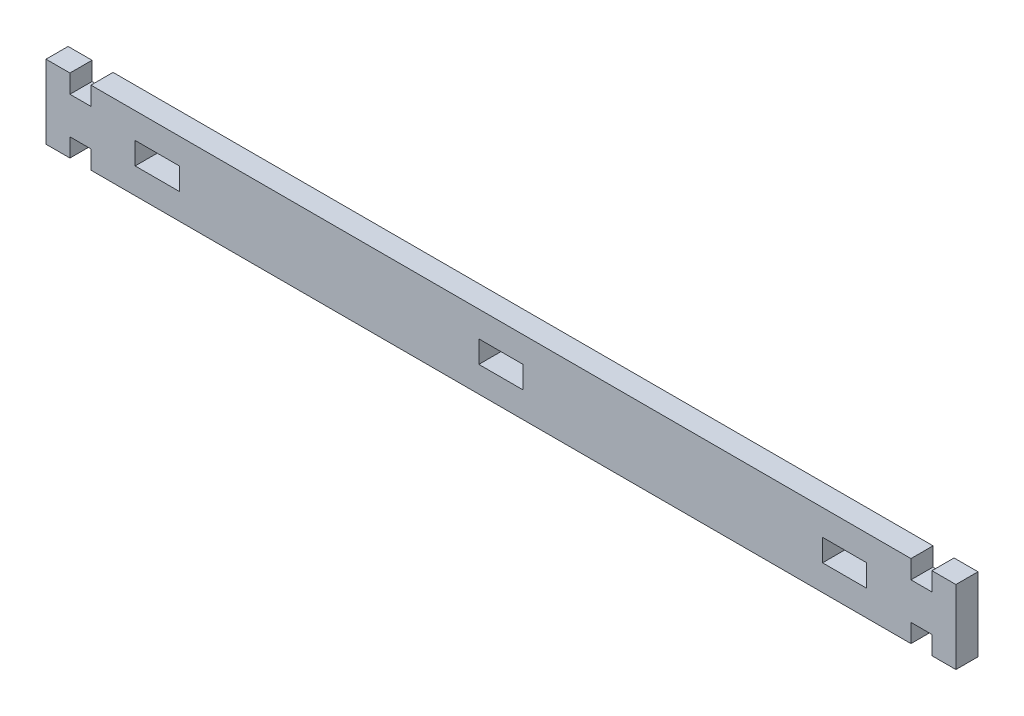
ISO-10303-21;
HEADER;
FILE_DESCRIPTION(('STEP AP214'),'2;1');
FILE_NAME('part.step','',(''),(''),'','','');
FILE_SCHEMA(('AUTOMOTIVE_DESIGN { 1 0 10303 214 1 1 1 1 }'));
ENDSEC;
DATA;
#1=APPLICATION_CONTEXT('core data for automotive mechanical design processes');
#2=APPLICATION_PROTOCOL_DEFINITION('international standard','automotive_design',2000,#1);
#3=PRODUCT_CONTEXT('',#1,'mechanical');
#4=PRODUCT('Part','Part','',(#3));
#5=PRODUCT_RELATED_PRODUCT_CATEGORY('part','',(#4));
#6=PRODUCT_DEFINITION_FORMATION('','',#4);
#7=PRODUCT_DEFINITION_CONTEXT('part definition',#1,'design');
#8=PRODUCT_DEFINITION('design','',#6,#7);
#9=PRODUCT_DEFINITION_SHAPE('','',#8);
#10=(LENGTH_UNIT() NAMED_UNIT(*) SI_UNIT(.MILLI.,.METRE.));
#11=(NAMED_UNIT(*) PLANE_ANGLE_UNIT() SI_UNIT($,.RADIAN.));
#12=(NAMED_UNIT(*) SI_UNIT($,.STERADIAN.) SOLID_ANGLE_UNIT());
#13=UNCERTAINTY_MEASURE_WITH_UNIT(LENGTH_MEASURE(1.E-05),#10,'distance_accuracy_value','');
#14=(GEOMETRIC_REPRESENTATION_CONTEXT(3) GLOBAL_UNCERTAINTY_ASSIGNED_CONTEXT((#13)) GLOBAL_UNIT_ASSIGNED_CONTEXT((#10,
#11,#12)) REPRESENTATION_CONTEXT('',''));
#15=CARTESIAN_POINT('',(0.,0.,0.));
#16=DIRECTION('',(0.,0.,1.));
#17=DIRECTION('',(1.,0.,0.));
#18=AXIS2_PLACEMENT_3D('',#15,#16,#17);
#19=CARTESIAN_POINT('',(0.,-3.,-6.));
#20=DIRECTION('',(0.,1.,0.));
#21=DIRECTION('',(-1.,0.,0.));
#22=AXIS2_PLACEMENT_3D('',#19,#20,#21);
#23=PLANE('',#22);
#24=DIRECTION('',(-1.,0.,0.));
#25=VECTOR('',#24,1.);
#26=CARTESIAN_POINT('',(0.,-3.,0.));
#27=LINE('',#26,#25);
#28=CARTESIAN_POINT('',(6.,-3.,0.));
#29=VERTEX_POINT('',#28);
#30=CARTESIAN_POINT('',(-6.,-3.,0.));
#31=VERTEX_POINT('',#30);
#32=EDGE_CURVE('E359',#29,#31,#27,.T.);
#33=ORIENTED_EDGE('',*,*,#32,.F.);
#34=DIRECTION('',(0.,0.,1.));
#35=VECTOR('',#34,1.);
#36=CARTESIAN_POINT('',(6.,-3.,-6.));
#37=LINE('',#36,#35);
#38=CARTESIAN_POINT('',(6.,-3.,-6.));
#39=VERTEX_POINT('',#38);
#40=EDGE_CURVE('E11',#39,#29,#37,.T.);
#41=ORIENTED_EDGE('',*,*,#40,.F.);
#42=DIRECTION('',(-1.,0.,0.));
#43=VECTOR('',#42,1.);
#44=CARTESIAN_POINT('',(0.,-3.,-6.));
#45=LINE('',#44,#43);
#46=CARTESIAN_POINT('',(-6.,-3.,-6.));
#47=VERTEX_POINT('',#46);
#48=EDGE_CURVE('E277',#39,#47,#45,.T.);
#49=ORIENTED_EDGE('',*,*,#48,.T.);
#50=DIRECTION('',(0.,0.,1.));
#51=VECTOR('',#50,1.);
#52=CARTESIAN_POINT('',(-6.,-3.,-6.));
#53=LINE('',#52,#51);
#54=EDGE_CURVE('E274',#47,#31,#53,.T.);
#55=ORIENTED_EDGE('',*,*,#54,.T.);
#56=EDGE_LOOP('',(#33,#41,#49,#55));
#57=FACE_BOUND('',#56,.T.);
#58=ADVANCED_FACE('F41',(#57),#23,.T.);
#59=CARTESIAN_POINT('',(6.,0.,-6.));
#60=DIRECTION('',(1.,0.,0.));
#61=DIRECTION('',(0.,0.,-1.));
#62=AXIS2_PLACEMENT_3D('',#59,#60,#61);
#63=PLANE('',#62);
#64=DIRECTION('',(0.,1.,0.));
#65=VECTOR('',#64,1.);
#66=CARTESIAN_POINT('',(6.,0.,0.));
#67=LINE('',#66,#65);
#68=CARTESIAN_POINT('',(6.,3.,0.));
#69=VERTEX_POINT('',#68);
#70=EDGE_CURVE('E365',#29,#69,#67,.T.);
#71=ORIENTED_EDGE('',*,*,#70,.T.);
#72=DIRECTION('',(0.,0.,1.));
#73=VECTOR('',#72,1.);
#74=CARTESIAN_POINT('',(6.,3.,-6.));
#75=LINE('',#74,#73);
#76=CARTESIAN_POINT('',(6.,3.,-6.));
#77=VERTEX_POINT('',#76);
#78=EDGE_CURVE('E51',#77,#69,#75,.T.);
#79=ORIENTED_EDGE('',*,*,#78,.F.);
#80=DIRECTION('',(0.,1.,0.));
#81=VECTOR('',#80,1.);
#82=CARTESIAN_POINT('',(6.,0.,-6.));
#83=LINE('',#82,#81);
#84=EDGE_CURVE('E266',#39,#77,#83,.T.);
#85=ORIENTED_EDGE('',*,*,#84,.F.);
#86=ORIENTED_EDGE('',*,*,#40,.T.);
#87=EDGE_LOOP('',(#71,#79,#85,#86));
#88=FACE_BOUND('',#87,.T.);
#89=ADVANCED_FACE('F550',(#88),#63,.F.);
#90=CARTESIAN_POINT('',(0.,3.,-6.));
#91=DIRECTION('',(0.,1.,0.));
#92=DIRECTION('',(-1.,0.,0.));
#93=AXIS2_PLACEMENT_3D('',#90,#91,#92);
#94=PLANE('',#93);
#95=DIRECTION('',(-1.,0.,0.));
#96=VECTOR('',#95,1.);
#97=CARTESIAN_POINT('',(0.,3.,0.));
#98=LINE('',#97,#96);
#99=CARTESIAN_POINT('',(-6.,3.,0.));
#100=VERTEX_POINT('',#99);
#101=EDGE_CURVE('E160',#69,#100,#98,.T.);
#102=ORIENTED_EDGE('',*,*,#101,.T.);
#103=DIRECTION('',(0.,0.,1.));
#104=VECTOR('',#103,1.);
#105=CARTESIAN_POINT('',(-6.,3.,-6.));
#106=LINE('',#105,#104);
#107=CARTESIAN_POINT('',(-6.,3.,-6.));
#108=VERTEX_POINT('',#107);
#109=EDGE_CURVE('E270',#108,#100,#106,.T.);
#110=ORIENTED_EDGE('',*,*,#109,.F.);
#111=DIRECTION('',(-1.,0.,0.));
#112=VECTOR('',#111,1.);
#113=CARTESIAN_POINT('',(0.,3.,-6.));
#114=LINE('',#113,#112);
#115=EDGE_CURVE('E260',#77,#108,#114,.T.);
#116=ORIENTED_EDGE('',*,*,#115,.F.);
#117=ORIENTED_EDGE('',*,*,#78,.T.);
#118=EDGE_LOOP('',(#102,#110,#116,#117));
#119=FACE_BOUND('',#118,.T.);
#120=ADVANCED_FACE('F271',(#119),#94,.F.);
#121=CARTESIAN_POINT('',(-87.3,0.,-6.));
#122=DIRECTION('',(1.,0.,0.));
#123=DIRECTION('',(0.,0.,-1.));
#124=AXIS2_PLACEMENT_3D('',#121,#122,#123);
#125=PLANE('',#124);
#126=DIRECTION('',(0.,1.,0.));
#127=VECTOR('',#126,1.);
#128=CARTESIAN_POINT('',(-87.3,0.,0.));
#129=LINE('',#128,#127);
#130=CARTESIAN_POINT('',(-87.3,-3.00000000000001,0.));
#131=VERTEX_POINT('',#130);
#132=CARTESIAN_POINT('',(-87.3,2.99999999999999,0.));
#133=VERTEX_POINT('',#132);
#134=EDGE_CURVE('E348',#131,#133,#129,.T.);
#135=ORIENTED_EDGE('',*,*,#134,.T.);
#136=DIRECTION('',(0.,0.,1.));
#137=VECTOR('',#136,1.);
#138=CARTESIAN_POINT('',(-87.3,2.99999999999999,-6.));
#139=LINE('',#138,#137);
#140=CARTESIAN_POINT('',(-87.3,2.99999999999999,-6.));
#141=VERTEX_POINT('',#140);
#142=EDGE_CURVE('E370',#141,#133,#139,.T.);
#143=ORIENTED_EDGE('',*,*,#142,.F.);
#144=DIRECTION('',(0.,1.,0.));
#145=VECTOR('',#144,1.);
#146=CARTESIAN_POINT('',(-87.3,0.,-6.));
#147=LINE('',#146,#145);
#148=CARTESIAN_POINT('',(-87.3,-3.00000000000001,-6.));
#149=VERTEX_POINT('',#148);
#150=EDGE_CURVE('E508',#149,#141,#147,.T.);
#151=ORIENTED_EDGE('',*,*,#150,.F.);
#152=DIRECTION('',(0.,0.,1.));
#153=VECTOR('',#152,1.);
#154=CARTESIAN_POINT('',(-87.3,-3.00000000000001,-6.));
#155=LINE('',#154,#153);
#156=EDGE_CURVE('E376',#149,#131,#155,.T.);
#157=ORIENTED_EDGE('',*,*,#156,.T.);
#158=EDGE_LOOP('',(#135,#143,#151,#157));
#159=FACE_BOUND('',#158,.T.);
#160=ADVANCED_FACE('F526',(#159),#125,.F.);
#161=CARTESIAN_POINT('',(0.,2.99999999999999,-6.));
#162=DIRECTION('',(0.,-1.,0.));
#163=DIRECTION('',(0.,0.,-1.));
#164=AXIS2_PLACEMENT_3D('',#161,#162,#163);
#165=PLANE('',#164);
#166=DIRECTION('',(1.,0.,0.));
#167=VECTOR('',#166,1.);
#168=CARTESIAN_POINT('',(0.,2.99999999999999,0.));
#169=LINE('',#168,#167);
#170=CARTESIAN_POINT('',(-99.3,2.99999999999999,0.));
#171=VERTEX_POINT('',#170);
#172=EDGE_CURVE('E356',#171,#133,#169,.T.);
#173=ORIENTED_EDGE('',*,*,#172,.F.);
#174=DIRECTION('',(0.,0.,1.));
#175=VECTOR('',#174,1.);
#176=CARTESIAN_POINT('',(-99.3,2.99999999999999,-6.));
#177=LINE('',#176,#175);
#178=CARTESIAN_POINT('',(-99.3,2.99999999999999,-6.));
#179=VERTEX_POINT('',#178);
#180=EDGE_CURVE('E372',#179,#171,#177,.T.);
#181=ORIENTED_EDGE('',*,*,#180,.F.);
#182=DIRECTION('',(1.,0.,0.));
#183=VECTOR('',#182,1.);
#184=CARTESIAN_POINT('',(0.,2.99999999999999,-6.));
#185=LINE('',#184,#183);
#186=EDGE_CURVE('E279',#179,#141,#185,.T.);
#187=ORIENTED_EDGE('',*,*,#186,.T.);
#188=ORIENTED_EDGE('',*,*,#142,.T.);
#189=EDGE_LOOP('',(#173,#181,#187,#188));
#190=FACE_BOUND('',#189,.T.);
#191=ADVANCED_FACE('F518',(#190),#165,.T.);
#192=CARTESIAN_POINT('',(-99.3,0.,-6.));
#193=DIRECTION('',(1.,0.,0.));
#194=DIRECTION('',(0.,0.,-1.));
#195=AXIS2_PLACEMENT_3D('',#192,#193,#194);
#196=PLANE('',#195);
#197=DIRECTION('',(0.,1.,0.));
#198=VECTOR('',#197,1.);
#199=CARTESIAN_POINT('',(-99.3,0.,0.));
#200=LINE('',#199,#198);
#201=CARTESIAN_POINT('',(-99.3,-3.00000000000001,0.));
#202=VERTEX_POINT('',#201);
#203=EDGE_CURVE('E353',#202,#171,#200,.T.);
#204=ORIENTED_EDGE('',*,*,#203,.F.);
#205=DIRECTION('',(0.,0.,1.));
#206=VECTOR('',#205,1.);
#207=CARTESIAN_POINT('',(-99.3,-3.00000000000001,-6.));
#208=LINE('',#207,#206);
#209=CARTESIAN_POINT('',(-99.3,-3.00000000000001,-6.));
#210=VERTEX_POINT('',#209);
#211=EDGE_CURVE('E374',#210,#202,#208,.T.);
#212=ORIENTED_EDGE('',*,*,#211,.F.);
#213=DIRECTION('',(0.,1.,0.));
#214=VECTOR('',#213,1.);
#215=CARTESIAN_POINT('',(-99.3,0.,-6.));
#216=LINE('',#215,#214);
#217=EDGE_CURVE('E512',#210,#179,#216,.T.);
#218=ORIENTED_EDGE('',*,*,#217,.T.);
#219=ORIENTED_EDGE('',*,*,#180,.T.);
#220=EDGE_LOOP('',(#204,#212,#218,#219));
#221=FACE_BOUND('',#220,.T.);
#222=ADVANCED_FACE('F532',(#221),#196,.T.);
#223=CARTESIAN_POINT('',(99.3,0.,-6.));
#224=DIRECTION('',(1.,0.,0.));
#225=DIRECTION('',(0.,0.,-1.));
#226=AXIS2_PLACEMENT_3D('',#223,#224,#225);
#227=PLANE('',#226);
#228=DIRECTION('',(0.,1.,0.));
#229=VECTOR('',#228,1.);
#230=CARTESIAN_POINT('',(99.3,0.,0.));
#231=LINE('',#230,#229);
#232=CARTESIAN_POINT('',(99.3,-3.,0.));
#233=VERTEX_POINT('',#232);
#234=CARTESIAN_POINT('',(99.3,3.,0.));
#235=VERTEX_POINT('',#234);
#236=EDGE_CURVE('E337',#233,#235,#231,.T.);
#237=ORIENTED_EDGE('',*,*,#236,.T.);
#238=DIRECTION('',(0.,0.,1.));
#239=VECTOR('',#238,1.);
#240=CARTESIAN_POINT('',(99.3,3.,-6.));
#241=LINE('',#240,#239);
#242=CARTESIAN_POINT('',(99.3,3.,-6.));
#243=VERTEX_POINT('',#242);
#244=EDGE_CURVE('E379',#243,#235,#241,.T.);
#245=ORIENTED_EDGE('',*,*,#244,.F.);
#246=DIRECTION('',(0.,1.,0.));
#247=VECTOR('',#246,1.);
#248=CARTESIAN_POINT('',(99.3,0.,-6.));
#249=LINE('',#248,#247);
#250=CARTESIAN_POINT('',(99.3,-3.,-6.));
#251=VERTEX_POINT('',#250);
#252=EDGE_CURVE('E448',#251,#243,#249,.T.);
#253=ORIENTED_EDGE('',*,*,#252,.F.);
#254=DIRECTION('',(0.,0.,1.));
#255=VECTOR('',#254,1.);
#256=CARTESIAN_POINT('',(99.3,-3.,-6.));
#257=LINE('',#256,#255);
#258=EDGE_CURVE('E385',#251,#233,#257,.T.);
#259=ORIENTED_EDGE('',*,*,#258,.T.);
#260=EDGE_LOOP('',(#237,#245,#253,#259));
#261=FACE_BOUND('',#260,.T.);
#262=ADVANCED_FACE('F561',(#261),#227,.F.);
#263=CARTESIAN_POINT('',(0.,3.,-6.));
#264=DIRECTION('',(0.,-1.,0.));
#265=DIRECTION('',(0.,0.,-1.));
#266=AXIS2_PLACEMENT_3D('',#263,#264,#265);
#267=PLANE('',#266);
#268=DIRECTION('',(1.,0.,0.));
#269=VECTOR('',#268,1.);
#270=CARTESIAN_POINT('',(0.,3.,0.));
#271=LINE('',#270,#269);
#272=CARTESIAN_POINT('',(87.3,3.,0.));
#273=VERTEX_POINT('',#272);
#274=EDGE_CURVE('E345',#273,#235,#271,.T.);
#275=ORIENTED_EDGE('',*,*,#274,.F.);
#276=DIRECTION('',(0.,0.,1.));
#277=VECTOR('',#276,1.);
#278=CARTESIAN_POINT('',(87.3,3.,-6.));
#279=LINE('',#278,#277);
#280=CARTESIAN_POINT('',(87.3,3.,-6.));
#281=VERTEX_POINT('',#280);
#282=EDGE_CURVE('E381',#281,#273,#279,.T.);
#283=ORIENTED_EDGE('',*,*,#282,.F.);
#284=DIRECTION('',(1.,0.,0.));
#285=VECTOR('',#284,1.);
#286=CARTESIAN_POINT('',(0.,3.,-6.));
#287=LINE('',#286,#285);
#288=EDGE_CURVE('E505',#281,#243,#287,.T.);
#289=ORIENTED_EDGE('',*,*,#288,.T.);
#290=ORIENTED_EDGE('',*,*,#244,.T.);
#291=EDGE_LOOP('',(#275,#283,#289,#290));
#292=FACE_BOUND('',#291,.T.);
#293=ADVANCED_FACE('F565',(#292),#267,.T.);
#294=CARTESIAN_POINT('',(87.3,2.019218126037E-13,-6.));
#295=DIRECTION('',(1.,0.,0.));
#296=DIRECTION('',(0.,1.,0.));
#297=AXIS2_PLACEMENT_3D('',#294,#295,#296);
#298=PLANE('',#297);
#299=DIRECTION('',(0.,1.,0.));
#300=VECTOR('',#299,1.);
#301=CARTESIAN_POINT('',(87.3,2.019218126037E-13,0.));
#302=LINE('',#301,#300);
#303=CARTESIAN_POINT('',(87.3,-3.,0.));
#304=VERTEX_POINT('',#303);
#305=EDGE_CURVE('E342',#304,#273,#302,.T.);
#306=ORIENTED_EDGE('',*,*,#305,.F.);
#307=DIRECTION('',(0.,0.,1.));
#308=VECTOR('',#307,1.);
#309=CARTESIAN_POINT('',(87.3,-3.,-6.));
#310=LINE('',#309,#308);
#311=CARTESIAN_POINT('',(87.3,-3.,-6.));
#312=VERTEX_POINT('',#311);
#313=EDGE_CURVE('E383',#312,#304,#310,.T.);
#314=ORIENTED_EDGE('',*,*,#313,.F.);
#315=DIRECTION('',(0.,1.,0.));
#316=VECTOR('',#315,1.);
#317=CARTESIAN_POINT('',(87.3,2.019218126037E-13,-6.));
#318=LINE('',#317,#316);
#319=EDGE_CURVE('E502',#312,#281,#318,.T.);
#320=ORIENTED_EDGE('',*,*,#319,.T.);
#321=ORIENTED_EDGE('',*,*,#282,.T.);
#322=EDGE_LOOP('',(#306,#314,#320,#321));
#323=FACE_BOUND('',#322,.T.);
#324=ADVANCED_FACE('F571',(#323),#298,.T.);
#325=CARTESIAN_POINT('',(-117.,0.,-6.));
#326=DIRECTION('',(-1.,0.,0.));
#327=DIRECTION('',(0.,0.,1.));
#328=AXIS2_PLACEMENT_3D('',#325,#326,#327);
#329=PLANE('',#328);
#330=DIRECTION('',(0.,-1.,0.));
#331=VECTOR('',#330,1.);
#332=CARTESIAN_POINT('',(-117.,0.,0.));
#333=LINE('',#332,#331);
#334=CARTESIAN_POINT('',(-117.,9.99999999999999,0.));
#335=VERTEX_POINT('',#334);
#336=CARTESIAN_POINT('',(-117.,4.99999999999999,0.));
#337=VERTEX_POINT('',#336);
#338=EDGE_CURVE('E284',#335,#337,#333,.T.);
#339=ORIENTED_EDGE('',*,*,#338,.T.);
#340=DIRECTION('',(0.,0.,1.));
#341=VECTOR('',#340,1.);
#342=CARTESIAN_POINT('',(-117.,4.99999999999999,-6.));
#343=LINE('',#342,#341);
#344=CARTESIAN_POINT('',(-117.,4.99999999999999,-6.));
#345=VERTEX_POINT('',#344);
#346=EDGE_CURVE('E388',#345,#337,#343,.T.);
#347=ORIENTED_EDGE('',*,*,#346,.F.);
#348=DIRECTION('',(0.,-1.,0.));
#349=VECTOR('',#348,1.);
#350=CARTESIAN_POINT('',(-117.,0.,-6.));
#351=LINE('',#350,#349);
#352=CARTESIAN_POINT('',(-117.,9.99999999999999,-6.));
#353=VERTEX_POINT('',#352);
#354=EDGE_CURVE('E366',#353,#345,#351,.T.);
#355=ORIENTED_EDGE('',*,*,#354,.F.);
#356=DIRECTION('',(0.,0.,1.));
#357=VECTOR('',#356,1.);
#358=CARTESIAN_POINT('',(-117.,9.99999999999999,-6.));
#359=LINE('',#358,#357);
#360=EDGE_CURVE('E45',#353,#335,#359,.T.);
#361=ORIENTED_EDGE('',*,*,#360,.T.);
#362=EDGE_LOOP('',(#339,#347,#355,#361));
#363=FACE_BOUND('',#362,.T.);
#364=ADVANCED_FACE('F434',(#363),#329,.F.);
#365=CARTESIAN_POINT('',(0.,5.00000000000001,-6.));
#366=DIRECTION('',(0.,-1.,0.));
#367=DIRECTION('',(1.,0.,0.));
#368=AXIS2_PLACEMENT_3D('',#365,#366,#367);
#369=PLANE('',#368);
#370=DIRECTION('',(1.,0.,0.));
#371=VECTOR('',#370,1.);
#372=CARTESIAN_POINT('',(0.,5.00000000000001,0.));
#373=LINE('',#372,#371);
#374=CARTESIAN_POINT('',(-111.3,4.99999999999999,0.));
#375=VERTEX_POINT('',#374);
#376=EDGE_CURVE('E334',#337,#375,#373,.T.);
#377=ORIENTED_EDGE('',*,*,#376,.T.);
#378=DIRECTION('',(0.,0.,1.));
#379=VECTOR('',#378,1.);
#380=CARTESIAN_POINT('',(-111.3,4.99999999999999,-6.));
#381=LINE('',#380,#379);
#382=CARTESIAN_POINT('',(-111.3,4.99999999999999,-6.));
#383=VERTEX_POINT('',#382);
#384=EDGE_CURVE('E391',#383,#375,#381,.T.);
#385=ORIENTED_EDGE('',*,*,#384,.F.);
#386=DIRECTION('',(1.,0.,0.));
#387=VECTOR('',#386,1.);
#388=CARTESIAN_POINT('',(0.,5.00000000000001,-6.));
#389=LINE('',#388,#387);
#390=EDGE_CURVE('E445',#345,#383,#389,.T.);
#391=ORIENTED_EDGE('',*,*,#390,.F.);
#392=ORIENTED_EDGE('',*,*,#346,.T.);
#393=EDGE_LOOP('',(#377,#385,#391,#392));
#394=FACE_BOUND('',#393,.T.);
#395=ADVANCED_FACE('F444',(#394),#369,.F.);
#396=CARTESIAN_POINT('',(-111.3,0.,-6.));
#397=DIRECTION('',(-1.,0.,0.));
#398=DIRECTION('',(0.,0.,1.));
#399=AXIS2_PLACEMENT_3D('',#396,#397,#398);
#400=PLANE('',#399);
#401=DIRECTION('',(0.,-1.,0.));
#402=VECTOR('',#401,1.);
#403=CARTESIAN_POINT('',(-111.3,0.,0.));
#404=LINE('',#403,#402);
#405=CARTESIAN_POINT('',(-111.3,9.99999999999999,0.));
#406=VERTEX_POINT('',#405);
#407=EDGE_CURVE('E331',#406,#375,#404,.T.);
#408=ORIENTED_EDGE('',*,*,#407,.F.);
#409=DIRECTION('',(0.,0.,1.));
#410=VECTOR('',#409,1.);
#411=CARTESIAN_POINT('',(-111.3,9.99999999999999,-6.));
#412=LINE('',#411,#410);
#413=CARTESIAN_POINT('',(-111.3,9.99999999999999,-6.));
#414=VERTEX_POINT('',#413);
#415=EDGE_CURVE('E393',#414,#406,#412,.T.);
#416=ORIENTED_EDGE('',*,*,#415,.F.);
#417=DIRECTION('',(0.,-1.,0.));
#418=VECTOR('',#417,1.);
#419=CARTESIAN_POINT('',(-111.3,0.,-6.));
#420=LINE('',#419,#418);
#421=EDGE_CURVE('E449',#414,#383,#420,.T.);
#422=ORIENTED_EDGE('',*,*,#421,.T.);
#423=ORIENTED_EDGE('',*,*,#384,.T.);
#424=EDGE_LOOP('',(#408,#416,#422,#423));
#425=FACE_BOUND('',#424,.T.);
#426=ADVANCED_FACE('F578',(#425),#400,.T.);
#427=CARTESIAN_POINT('',(0.,10.,-6.));
#428=DIRECTION('',(0.,-1.,0.));
#429=DIRECTION('',(1.,0.,0.));
#430=AXIS2_PLACEMENT_3D('',#427,#428,#429);
#431=PLANE('',#430);
#432=DIRECTION('',(1.,0.,0.));
#433=VECTOR('',#432,1.);
#434=CARTESIAN_POINT('',(0.,10.,0.));
#435=LINE('',#434,#433);
#436=CARTESIAN_POINT('',(111.3,10.,0.));
#437=VERTEX_POINT('',#436);
#438=EDGE_CURVE('E329',#406,#437,#435,.T.);
#439=ORIENTED_EDGE('',*,*,#438,.T.);
#440=DIRECTION('',(0.,0.,1.));
#441=VECTOR('',#440,1.);
#442=CARTESIAN_POINT('',(111.3,10.,-6.));
#443=LINE('',#442,#441);
#444=CARTESIAN_POINT('',(111.3,10.,-6.));
#445=VERTEX_POINT('',#444);
#446=EDGE_CURVE('E395',#445,#437,#443,.T.);
#447=ORIENTED_EDGE('',*,*,#446,.F.);
#448=DIRECTION('',(1.,0.,0.));
#449=VECTOR('',#448,1.);
#450=CARTESIAN_POINT('',(0.,10.,-6.));
#451=LINE('',#450,#449);
#452=EDGE_CURVE('E496',#414,#445,#451,.T.);
#453=ORIENTED_EDGE('',*,*,#452,.F.);
#454=ORIENTED_EDGE('',*,*,#415,.T.);
#455=EDGE_LOOP('',(#439,#447,#453,#454));
#456=FACE_BOUND('',#455,.T.);
#457=ADVANCED_FACE('F581',(#456),#431,.F.);
#458=CARTESIAN_POINT('',(111.3,0.,-6.));
#459=DIRECTION('',(-1.,0.,0.));
#460=DIRECTION('',(0.,0.,1.));
#461=AXIS2_PLACEMENT_3D('',#458,#459,#460);
#462=PLANE('',#461);
#463=DIRECTION('',(0.,-1.,0.));
#464=VECTOR('',#463,1.);
#465=CARTESIAN_POINT('',(111.3,0.,0.));
#466=LINE('',#465,#464);
#467=CARTESIAN_POINT('',(111.3,5.00000000000002,0.));
#468=VERTEX_POINT('',#467);
#469=EDGE_CURVE('E326',#437,#468,#466,.T.);
#470=ORIENTED_EDGE('',*,*,#469,.T.);
#471=DIRECTION('',(0.,0.,1.));
#472=VECTOR('',#471,1.);
#473=CARTESIAN_POINT('',(111.3,5.00000000000002,-6.));
#474=LINE('',#473,#472);
#475=CARTESIAN_POINT('',(111.3,5.00000000000002,-6.));
#476=VERTEX_POINT('',#475);
#477=EDGE_CURVE('E398',#476,#468,#474,.T.);
#478=ORIENTED_EDGE('',*,*,#477,.F.);
#479=DIRECTION('',(0.,-1.,0.));
#480=VECTOR('',#479,1.);
#481=CARTESIAN_POINT('',(111.3,0.,-6.));
#482=LINE('',#481,#480);
#483=EDGE_CURVE('E494',#445,#476,#482,.T.);
#484=ORIENTED_EDGE('',*,*,#483,.F.);
#485=ORIENTED_EDGE('',*,*,#446,.T.);
#486=EDGE_LOOP('',(#470,#478,#484,#485));
#487=FACE_BOUND('',#486,.T.);
#488=ADVANCED_FACE('F585',(#487),#462,.F.);
#489=CARTESIAN_POINT('',(0.,5.,-6.));
#490=DIRECTION('',(0.,1.,0.));
#491=DIRECTION('',(-1.,0.,0.));
#492=AXIS2_PLACEMENT_3D('',#489,#490,#491);
#493=PLANE('',#492);
#494=DIRECTION('',(-1.,0.,0.));
#495=VECTOR('',#494,1.);
#496=CARTESIAN_POINT('',(0.,5.,0.));
#497=LINE('',#496,#495);
#498=CARTESIAN_POINT('',(117.,5.00000000000002,0.));
#499=VERTEX_POINT('',#498);
#500=EDGE_CURVE('E323',#499,#468,#497,.T.);
#501=ORIENTED_EDGE('',*,*,#500,.F.);
#502=DIRECTION('',(0.,0.,1.));
#503=VECTOR('',#502,1.);
#504=CARTESIAN_POINT('',(117.,5.00000000000002,-6.));
#505=LINE('',#504,#503);
#506=CARTESIAN_POINT('',(117.,5.00000000000002,-6.));
#507=VERTEX_POINT('',#506);
#508=EDGE_CURVE('E400',#507,#499,#505,.T.);
#509=ORIENTED_EDGE('',*,*,#508,.F.);
#510=DIRECTION('',(-1.,0.,0.));
#511=VECTOR('',#510,1.);
#512=CARTESIAN_POINT('',(0.,5.,-6.));
#513=LINE('',#512,#511);
#514=EDGE_CURVE('E491',#507,#476,#513,.T.);
#515=ORIENTED_EDGE('',*,*,#514,.T.);
#516=ORIENTED_EDGE('',*,*,#477,.T.);
#517=EDGE_LOOP('',(#501,#509,#515,#516));
#518=FACE_BOUND('',#517,.T.);
#519=ADVANCED_FACE('F589',(#518),#493,.T.);
#520=CARTESIAN_POINT('',(117.,0.,-6.));
#521=DIRECTION('',(-1.,0.,0.));
#522=DIRECTION('',(0.,0.,1.));
#523=AXIS2_PLACEMENT_3D('',#520,#521,#522);
#524=PLANE('',#523);
#525=DIRECTION('',(0.,-1.,0.));
#526=VECTOR('',#525,1.);
#527=CARTESIAN_POINT('',(117.,0.,0.));
#528=LINE('',#527,#526);
#529=CARTESIAN_POINT('',(117.,10.,0.));
#530=VERTEX_POINT('',#529);
#531=EDGE_CURVE('E314',#530,#499,#528,.T.);
#532=ORIENTED_EDGE('',*,*,#531,.F.);
#533=DIRECTION('',(0.,0.,1.));
#534=VECTOR('',#533,1.);
#535=CARTESIAN_POINT('',(117.,10.,-6.));
#536=LINE('',#535,#534);
#537=CARTESIAN_POINT('',(117.,10.,-6.));
#538=VERTEX_POINT('',#537);
#539=EDGE_CURVE('E402',#538,#530,#536,.T.);
#540=ORIENTED_EDGE('',*,*,#539,.F.);
#541=DIRECTION('',(0.,-1.,0.));
#542=VECTOR('',#541,1.);
#543=CARTESIAN_POINT('',(117.,0.,-6.));
#544=LINE('',#543,#542);
#545=EDGE_CURVE('E483',#538,#507,#544,.T.);
#546=ORIENTED_EDGE('',*,*,#545,.T.);
#547=ORIENTED_EDGE('',*,*,#508,.T.);
#548=EDGE_LOOP('',(#532,#540,#546,#547));
#549=FACE_BOUND('',#548,.T.);
#550=ADVANCED_FACE('F593',(#549),#524,.T.);
#551=CARTESIAN_POINT('',(0.,10.,-6.));
#552=DIRECTION('',(0.,-1.,0.));
#553=DIRECTION('',(1.,0.,0.));
#554=AXIS2_PLACEMENT_3D('',#551,#552,#553);
#555=PLANE('',#554);
#556=DIRECTION('',(1.,0.,0.));
#557=VECTOR('',#556,1.);
#558=CARTESIAN_POINT('',(0.,10.,0.));
#559=LINE('',#558,#557);
#560=CARTESIAN_POINT('',(123.5,10.,0.));
#561=VERTEX_POINT('',#560);
#562=EDGE_CURVE('E320',#530,#561,#559,.T.);
#563=ORIENTED_EDGE('',*,*,#562,.T.);
#564=DIRECTION('',(0.,0.,1.));
#565=VECTOR('',#564,1.);
#566=CARTESIAN_POINT('',(123.5,10.,-6.));
#567=LINE('',#566,#565);
#568=CARTESIAN_POINT('',(123.5,10.,-6.));
#569=VERTEX_POINT('',#568);
#570=EDGE_CURVE('E404',#569,#561,#567,.T.);
#571=ORIENTED_EDGE('',*,*,#570,.F.);
#572=DIRECTION('',(1.,0.,0.));
#573=VECTOR('',#572,1.);
#574=CARTESIAN_POINT('',(0.,10.,-6.));
#575=LINE('',#574,#573);
#576=EDGE_CURVE('E489',#538,#569,#575,.T.);
#577=ORIENTED_EDGE('',*,*,#576,.F.);
#578=ORIENTED_EDGE('',*,*,#539,.T.);
#579=EDGE_LOOP('',(#563,#571,#577,#578));
#580=FACE_BOUND('',#579,.T.);
#581=ADVANCED_FACE('F597',(#580),#555,.F.);
#582=CARTESIAN_POINT('',(123.5,0.,-6.));
#583=DIRECTION('',(1.,0.,0.));
#584=DIRECTION('',(0.,0.,-1.));
#585=AXIS2_PLACEMENT_3D('',#582,#583,#584);
#586=PLANE('',#585);
#587=DIRECTION('',(0.,1.,0.));
#588=VECTOR('',#587,1.);
#589=CARTESIAN_POINT('',(123.5,0.,0.));
#590=LINE('',#589,#588);
#591=CARTESIAN_POINT('',(123.5,-9.99999999999998,0.));
#592=VERTEX_POINT('',#591);
#593=EDGE_CURVE('E317',#592,#561,#590,.T.);
#594=ORIENTED_EDGE('',*,*,#593,.F.);
#595=DIRECTION('',(0.,0.,1.));
#596=VECTOR('',#595,1.);
#597=CARTESIAN_POINT('',(123.5,-9.99999999999998,-6.));
#598=LINE('',#597,#596);
#599=CARTESIAN_POINT('',(123.5,-9.99999999999998,-6.));
#600=VERTEX_POINT('',#599);
#601=EDGE_CURVE('E406',#600,#592,#598,.T.);
#602=ORIENTED_EDGE('',*,*,#601,.F.);
#603=DIRECTION('',(0.,1.,0.));
#604=VECTOR('',#603,1.);
#605=CARTESIAN_POINT('',(123.5,0.,-6.));
#606=LINE('',#605,#604);
#607=EDGE_CURVE('E486',#600,#569,#606,.T.);
#608=ORIENTED_EDGE('',*,*,#607,.T.);
#609=ORIENTED_EDGE('',*,*,#570,.T.);
#610=EDGE_LOOP('',(#594,#602,#608,#609));
#611=FACE_BOUND('',#610,.T.);
#612=ADVANCED_FACE('F602',(#611),#586,.T.);
#613=CARTESIAN_POINT('',(0.,-9.99999999999999,-6.));
#614=DIRECTION('',(0.,-1.,0.));
#615=DIRECTION('',(1.,0.,0.));
#616=AXIS2_PLACEMENT_3D('',#613,#614,#615);
#617=PLANE('',#616);
#618=DIRECTION('',(1.,0.,0.));
#619=VECTOR('',#618,1.);
#620=CARTESIAN_POINT('',(0.,-9.99999999999999,0.));
#621=LINE('',#620,#619);
#622=CARTESIAN_POINT('',(117.,-9.99999999999998,0.));
#623=VERTEX_POINT('',#622);
#624=EDGE_CURVE('E313',#623,#592,#621,.T.);
#625=ORIENTED_EDGE('',*,*,#624,.F.);
#626=DIRECTION('',(0.,0.,1.));
#627=VECTOR('',#626,1.);
#628=CARTESIAN_POINT('',(117.,-9.99999999999998,-6.));
#629=LINE('',#628,#627);
#630=CARTESIAN_POINT('',(117.,-9.99999999999998,-6.));
#631=VERTEX_POINT('',#630);
#632=EDGE_CURVE('E408',#631,#623,#629,.T.);
#633=ORIENTED_EDGE('',*,*,#632,.F.);
#634=DIRECTION('',(1.,0.,0.));
#635=VECTOR('',#634,1.);
#636=CARTESIAN_POINT('',(0.,-9.99999999999999,-6.));
#637=LINE('',#636,#635);
#638=EDGE_CURVE('E482',#631,#600,#637,.T.);
#639=ORIENTED_EDGE('',*,*,#638,.T.);
#640=ORIENTED_EDGE('',*,*,#601,.T.);
#641=EDGE_LOOP('',(#625,#633,#639,#640));
#642=FACE_BOUND('',#641,.T.);
#643=ADVANCED_FACE('F606',(#642),#617,.T.);
#644=CARTESIAN_POINT('',(117.,-4.99999999999998,0.));
#645=VERTEX_POINT('',#644);
#646=EDGE_CURVE('E310',#645,#623,#528,.T.);
#647=ORIENTED_EDGE('',*,*,#646,.F.);
#648=DIRECTION('',(0.,0.,1.));
#649=VECTOR('',#648,1.);
#650=CARTESIAN_POINT('',(117.,-4.99999999999998,-6.));
#651=LINE('',#650,#649);
#652=CARTESIAN_POINT('',(117.,-4.99999999999998,-6.));
#653=VERTEX_POINT('',#652);
#654=EDGE_CURVE('E410',#653,#645,#651,.T.);
#655=ORIENTED_EDGE('',*,*,#654,.F.);
#656=EDGE_CURVE('E479',#653,#631,#544,.T.);
#657=ORIENTED_EDGE('',*,*,#656,.T.);
#658=ORIENTED_EDGE('',*,*,#632,.T.);
#659=EDGE_LOOP('',(#647,#655,#657,#658));
#660=FACE_BOUND('',#659,.T.);
#661=ADVANCED_FACE('F599',(#660),#524,.T.);
#662=CARTESIAN_POINT('',(0.,-5.00000000000001,-6.));
#663=DIRECTION('',(0.,1.,0.));
#664=DIRECTION('',(-1.,0.,0.));
#665=AXIS2_PLACEMENT_3D('',#662,#663,#664);
#666=PLANE('',#665);
#667=DIRECTION('',(-1.,0.,0.));
#668=VECTOR('',#667,1.);
#669=CARTESIAN_POINT('',(0.,-5.00000000000001,0.));
#670=LINE('',#669,#668);
#671=CARTESIAN_POINT('',(111.3,-4.99999999999998,0.));
#672=VERTEX_POINT('',#671);
#673=EDGE_CURVE('E307',#645,#672,#670,.T.);
#674=ORIENTED_EDGE('',*,*,#673,.T.);
#675=DIRECTION('',(0.,0.,1.));
#676=VECTOR('',#675,1.);
#677=CARTESIAN_POINT('',(111.3,-4.99999999999998,-6.));
#678=LINE('',#677,#676);
#679=CARTESIAN_POINT('',(111.3,-4.99999999999998,-6.));
#680=VERTEX_POINT('',#679);
#681=EDGE_CURVE('E412',#680,#672,#678,.T.);
#682=ORIENTED_EDGE('',*,*,#681,.F.);
#683=DIRECTION('',(-1.,0.,0.));
#684=VECTOR('',#683,1.);
#685=CARTESIAN_POINT('',(0.,-5.00000000000001,-6.));
#686=LINE('',#685,#684);
#687=EDGE_CURVE('E477',#653,#680,#686,.T.);
#688=ORIENTED_EDGE('',*,*,#687,.F.);
#689=ORIENTED_EDGE('',*,*,#654,.T.);
#690=EDGE_LOOP('',(#674,#682,#688,#689));
#691=FACE_BOUND('',#690,.T.);
#692=ADVANCED_FACE('F611',(#691),#666,.F.);
#693=CARTESIAN_POINT('',(111.3,1.2356782264078E-12,-6.));
#694=DIRECTION('',(1.,0.,0.));
#695=DIRECTION('',(0.,1.,0.));
#696=AXIS2_PLACEMENT_3D('',#693,#694,#695);
#697=PLANE('',#696);
#698=DIRECTION('',(0.,1.,0.));
#699=VECTOR('',#698,1.);
#700=CARTESIAN_POINT('',(111.3,1.2356782264078E-12,0.));
#701=LINE('',#700,#699);
#702=CARTESIAN_POINT('',(111.3,-9.99999999999998,0.));
#703=VERTEX_POINT('',#702);
#704=EDGE_CURVE('E304',#703,#672,#701,.T.);
#705=ORIENTED_EDGE('',*,*,#704,.F.);
#706=DIRECTION('',(0.,0.,1.));
#707=VECTOR('',#706,1.);
#708=CARTESIAN_POINT('',(111.3,-9.99999999999998,-6.));
#709=LINE('',#708,#707);
#710=CARTESIAN_POINT('',(111.3,-9.99999999999998,-6.));
#711=VERTEX_POINT('',#710);
#712=EDGE_CURVE('E414',#711,#703,#709,.T.);
#713=ORIENTED_EDGE('',*,*,#712,.F.);
#714=DIRECTION('',(0.,1.,0.));
#715=VECTOR('',#714,1.);
#716=CARTESIAN_POINT('',(111.3,1.2356782264078E-12,-6.));
#717=LINE('',#716,#715);
#718=EDGE_CURVE('E474',#711,#680,#717,.T.);
#719=ORIENTED_EDGE('',*,*,#718,.T.);
#720=ORIENTED_EDGE('',*,*,#681,.T.);
#721=EDGE_LOOP('',(#705,#713,#719,#720));
#722=FACE_BOUND('',#721,.T.);
#723=ADVANCED_FACE('F614',(#722),#697,.T.);
#724=CARTESIAN_POINT('',(0.,-9.99999999999999,-6.));
#725=DIRECTION('',(0.,-1.,0.));
#726=DIRECTION('',(1.,0.,0.));
#727=AXIS2_PLACEMENT_3D('',#724,#725,#726);
#728=PLANE('',#727);
#729=DIRECTION('',(1.,0.,0.));
#730=VECTOR('',#729,1.);
#731=CARTESIAN_POINT('',(0.,-9.99999999999999,0.));
#732=LINE('',#731,#730);
#733=CARTESIAN_POINT('',(-111.3,-10.,0.));
#734=VERTEX_POINT('',#733);
#735=EDGE_CURVE('E301',#734,#703,#732,.T.);
#736=ORIENTED_EDGE('',*,*,#735,.F.);
#737=DIRECTION('',(0.,0.,1.));
#738=VECTOR('',#737,1.);
#739=CARTESIAN_POINT('',(-111.3,-10.,-6.));
#740=LINE('',#739,#738);
#741=CARTESIAN_POINT('',(-111.3,-10.,-6.));
#742=VERTEX_POINT('',#741);
#743=EDGE_CURVE('E416',#742,#734,#740,.T.);
#744=ORIENTED_EDGE('',*,*,#743,.F.);
#745=DIRECTION('',(1.,0.,0.));
#746=VECTOR('',#745,1.);
#747=CARTESIAN_POINT('',(0.,-9.99999999999999,-6.));
#748=LINE('',#747,#746);
#749=EDGE_CURVE('E471',#742,#711,#748,.T.);
#750=ORIENTED_EDGE('',*,*,#749,.T.);
#751=ORIENTED_EDGE('',*,*,#712,.T.);
#752=EDGE_LOOP('',(#736,#744,#750,#751));
#753=FACE_BOUND('',#752,.T.);
#754=ADVANCED_FACE('F618',(#753),#728,.T.);
#755=CARTESIAN_POINT('',(-111.3,1.2356782264078E-12,-6.));
#756=DIRECTION('',(1.,0.,0.));
#757=DIRECTION('',(0.,1.,0.));
#758=AXIS2_PLACEMENT_3D('',#755,#756,#757);
#759=PLANE('',#758);
#760=DIRECTION('',(0.,1.,0.));
#761=VECTOR('',#760,1.);
#762=CARTESIAN_POINT('',(-111.3,1.2356782264078E-12,0.));
#763=LINE('',#762,#761);
#764=CARTESIAN_POINT('',(-111.3,-5.00000000000001,0.));
#765=VERTEX_POINT('',#764);
#766=EDGE_CURVE('E298',#734,#765,#763,.T.);
#767=ORIENTED_EDGE('',*,*,#766,.T.);
#768=DIRECTION('',(0.,0.,1.));
#769=VECTOR('',#768,1.);
#770=CARTESIAN_POINT('',(-111.3,-5.00000000000001,-6.));
#771=LINE('',#770,#769);
#772=CARTESIAN_POINT('',(-111.3,-5.00000000000001,-6.));
#773=VERTEX_POINT('',#772);
#774=EDGE_CURVE('E418',#773,#765,#771,.T.);
#775=ORIENTED_EDGE('',*,*,#774,.F.);
#776=DIRECTION('',(0.,1.,0.));
#777=VECTOR('',#776,1.);
#778=CARTESIAN_POINT('',(-111.3,1.2356782264078E-12,-6.));
#779=LINE('',#778,#777);
#780=EDGE_CURVE('E463',#742,#773,#779,.T.);
#781=ORIENTED_EDGE('',*,*,#780,.F.);
#782=ORIENTED_EDGE('',*,*,#743,.T.);
#783=EDGE_LOOP('',(#767,#775,#781,#782));
#784=FACE_BOUND('',#783,.T.);
#785=ADVANCED_FACE('F622',(#784),#759,.F.);
#786=CARTESIAN_POINT('',(0.,-5.00000000000001,-6.));
#787=DIRECTION('',(0.,-1.,0.));
#788=DIRECTION('',(0.,0.,-1.));
#789=AXIS2_PLACEMENT_3D('',#786,#787,#788);
#790=PLANE('',#789);
#791=DIRECTION('',(1.,0.,0.));
#792=VECTOR('',#791,1.);
#793=CARTESIAN_POINT('',(0.,-5.00000000000001,0.));
#794=LINE('',#793,#792);
#795=CARTESIAN_POINT('',(-117.,-5.00000000000001,0.));
#796=VERTEX_POINT('',#795);
#797=EDGE_CURVE('E295',#796,#765,#794,.T.);
#798=ORIENTED_EDGE('',*,*,#797,.F.);
#799=DIRECTION('',(0.,0.,1.));
#800=VECTOR('',#799,1.);
#801=CARTESIAN_POINT('',(-117.,-5.00000000000001,-6.));
#802=LINE('',#801,#800);
#803=CARTESIAN_POINT('',(-117.,-5.00000000000001,-6.));
#804=VERTEX_POINT('',#803);
#805=EDGE_CURVE('E420',#804,#796,#802,.T.);
#806=ORIENTED_EDGE('',*,*,#805,.F.);
#807=DIRECTION('',(1.,0.,0.));
#808=VECTOR('',#807,1.);
#809=CARTESIAN_POINT('',(0.,-5.00000000000001,-6.));
#810=LINE('',#809,#808);
#811=EDGE_CURVE('E456',#804,#773,#810,.T.);
#812=ORIENTED_EDGE('',*,*,#811,.T.);
#813=ORIENTED_EDGE('',*,*,#774,.T.);
#814=EDGE_LOOP('',(#798,#806,#812,#813));
#815=FACE_BOUND('',#814,.T.);
#816=ADVANCED_FACE('F626',(#815),#790,.T.);
#817=CARTESIAN_POINT('',(-117.,-10.,0.));
#818=VERTEX_POINT('',#817);
#819=EDGE_CURVE('E288',#796,#818,#333,.T.);
#820=ORIENTED_EDGE('',*,*,#819,.T.);
#821=DIRECTION('',(0.,0.,1.));
#822=VECTOR('',#821,1.);
#823=CARTESIAN_POINT('',(-117.,-10.,-6.));
#824=LINE('',#823,#822);
#825=CARTESIAN_POINT('',(-117.,-10.,-6.));
#826=VERTEX_POINT('',#825);
#827=EDGE_CURVE('E422',#826,#818,#824,.T.);
#828=ORIENTED_EDGE('',*,*,#827,.F.);
#829=EDGE_CURVE('E453',#804,#826,#351,.T.);
#830=ORIENTED_EDGE('',*,*,#829,.F.);
#831=ORIENTED_EDGE('',*,*,#805,.T.);
#832=EDGE_LOOP('',(#820,#828,#830,#831));
#833=FACE_BOUND('',#832,.T.);
#834=ADVANCED_FACE('F630',(#833),#329,.F.);
#835=CARTESIAN_POINT('',(0.,-9.99999999999999,-6.));
#836=DIRECTION('',(0.,-1.,0.));
#837=DIRECTION('',(1.,0.,0.));
#838=AXIS2_PLACEMENT_3D('',#835,#836,#837);
#839=PLANE('',#838);
#840=DIRECTION('',(1.,0.,0.));
#841=VECTOR('',#840,1.);
#842=CARTESIAN_POINT('',(0.,-9.99999999999999,0.));
#843=LINE('',#842,#841);
#844=CARTESIAN_POINT('',(-123.5,-10.,0.));
#845=VERTEX_POINT('',#844);
#846=EDGE_CURVE('E292',#845,#818,#843,.T.);
#847=ORIENTED_EDGE('',*,*,#846,.F.);
#848=DIRECTION('',(0.,0.,1.));
#849=VECTOR('',#848,1.);
#850=CARTESIAN_POINT('',(-123.5,-10.,-6.));
#851=LINE('',#850,#849);
#852=CARTESIAN_POINT('',(-123.5,-10.,-6.));
#853=VERTEX_POINT('',#852);
#854=EDGE_CURVE('E424',#853,#845,#851,.T.);
#855=ORIENTED_EDGE('',*,*,#854,.F.);
#856=DIRECTION('',(1.,0.,0.));
#857=VECTOR('',#856,1.);
#858=CARTESIAN_POINT('',(0.,-9.99999999999999,-6.));
#859=LINE('',#858,#857);
#860=EDGE_CURVE('E457',#853,#826,#859,.T.);
#861=ORIENTED_EDGE('',*,*,#860,.T.);
#862=ORIENTED_EDGE('',*,*,#827,.T.);
#863=EDGE_LOOP('',(#847,#855,#861,#862));
#864=FACE_BOUND('',#863,.T.);
#865=ADVANCED_FACE('F545',(#864),#839,.T.);
#866=CARTESIAN_POINT('',(-123.5,0.,-6.));
#867=DIRECTION('',(1.,0.,0.));
#868=DIRECTION('',(0.,0.,-1.));
#869=AXIS2_PLACEMENT_3D('',#866,#867,#868);
#870=PLANE('',#869);
#871=DIRECTION('',(0.,1.,0.));
#872=VECTOR('',#871,1.);
#873=CARTESIAN_POINT('',(-123.5,0.,0.));
#874=LINE('',#873,#872);
#875=CARTESIAN_POINT('',(-123.5,9.99999999999999,0.));
#876=VERTEX_POINT('',#875);
#877=EDGE_CURVE('E290',#845,#876,#874,.T.);
#878=ORIENTED_EDGE('',*,*,#877,.T.);
#879=DIRECTION('',(0.,0.,1.));
#880=VECTOR('',#879,1.);
#881=CARTESIAN_POINT('',(-123.5,9.99999999999999,-6.));
#882=LINE('',#881,#880);
#883=CARTESIAN_POINT('',(-123.5,9.99999999999999,-6.));
#884=VERTEX_POINT('',#883);
#885=EDGE_CURVE('E425',#884,#876,#882,.T.);
#886=ORIENTED_EDGE('',*,*,#885,.F.);
#887=DIRECTION('',(0.,1.,0.));
#888=VECTOR('',#887,1.);
#889=CARTESIAN_POINT('',(-123.5,0.,-6.));
#890=LINE('',#889,#888);
#891=EDGE_CURVE('E454',#853,#884,#890,.T.);
#892=ORIENTED_EDGE('',*,*,#891,.F.);
#893=ORIENTED_EDGE('',*,*,#854,.T.);
#894=EDGE_LOOP('',(#878,#886,#892,#893));
#895=FACE_BOUND('',#894,.T.);
#896=ADVANCED_FACE('F537',(#895),#870,.F.);
#897=CARTESIAN_POINT('',(0.,-3.00000000000001,-6.));
#898=DIRECTION('',(0.,-1.,0.));
#899=DIRECTION('',(0.,0.,-1.));
#900=AXIS2_PLACEMENT_3D('',#897,#898,#899);
#901=PLANE('',#900);
#902=DIRECTION('',(1.,0.,0.));
#903=VECTOR('',#902,1.);
#904=CARTESIAN_POINT('',(0.,-3.00000000000001,0.));
#905=LINE('',#904,#903);
#906=EDGE_CURVE('E351',#202,#131,#905,.T.);
#907=ORIENTED_EDGE('',*,*,#906,.T.);
#908=ORIENTED_EDGE('',*,*,#156,.F.);
#909=DIRECTION('',(1.,0.,0.));
#910=VECTOR('',#909,1.);
#911=CARTESIAN_POINT('',(0.,-3.00000000000001,-6.));
#912=LINE('',#911,#910);
#913=EDGE_CURVE('E510',#210,#149,#912,.T.);
#914=ORIENTED_EDGE('',*,*,#913,.F.);
#915=ORIENTED_EDGE('',*,*,#211,.T.);
#916=EDGE_LOOP('',(#907,#908,#914,#915));
#917=FACE_BOUND('',#916,.T.);
#918=ADVANCED_FACE('F534',(#917),#901,.F.);
#919=CARTESIAN_POINT('',(0.,-3.,-6.));
#920=DIRECTION('',(0.,-1.,0.));
#921=DIRECTION('',(0.,0.,-1.));
#922=AXIS2_PLACEMENT_3D('',#919,#920,#921);
#923=PLANE('',#922);
#924=DIRECTION('',(1.,0.,0.));
#925=VECTOR('',#924,1.);
#926=CARTESIAN_POINT('',(0.,-3.,0.));
#927=LINE('',#926,#925);
#928=EDGE_CURVE('E340',#304,#233,#927,.T.);
#929=ORIENTED_EDGE('',*,*,#928,.T.);
#930=ORIENTED_EDGE('',*,*,#258,.F.);
#931=DIRECTION('',(1.,0.,0.));
#932=VECTOR('',#931,1.);
#933=CARTESIAN_POINT('',(0.,-3.,-6.));
#934=LINE('',#933,#932);
#935=EDGE_CURVE('E500',#312,#251,#934,.T.);
#936=ORIENTED_EDGE('',*,*,#935,.F.);
#937=ORIENTED_EDGE('',*,*,#313,.T.);
#938=EDGE_LOOP('',(#929,#930,#936,#937));
#939=FACE_BOUND('',#938,.T.);
#940=ADVANCED_FACE('F536',(#939),#923,.F.);
#941=CARTESIAN_POINT('',(0.,10.,-6.));
#942=DIRECTION('',(0.,-1.,0.));
#943=DIRECTION('',(1.,0.,0.));
#944=AXIS2_PLACEMENT_3D('',#941,#942,#943);
#945=PLANE('',#944);
#946=DIRECTION('',(1.,0.,0.));
#947=VECTOR('',#946,1.);
#948=CARTESIAN_POINT('',(0.,10.,0.));
#949=LINE('',#948,#947);
#950=EDGE_CURVE('E287',#876,#335,#949,.T.);
#951=ORIENTED_EDGE('',*,*,#950,.T.);
#952=ORIENTED_EDGE('',*,*,#360,.F.);
#953=DIRECTION('',(1.,0.,0.));
#954=VECTOR('',#953,1.);
#955=CARTESIAN_POINT('',(0.,10.,-6.));
#956=LINE('',#955,#954);
#957=EDGE_CURVE('E172',#884,#353,#956,.T.);
#958=ORIENTED_EDGE('',*,*,#957,.F.);
#959=ORIENTED_EDGE('',*,*,#885,.T.);
#960=EDGE_LOOP('',(#951,#952,#958,#959));
#961=FACE_BOUND('',#960,.T.);
#962=ADVANCED_FACE('F43',(#961),#945,.F.);
#963=CARTESIAN_POINT('',(-6.,0.,-6.));
#964=DIRECTION('',(1.,0.,0.));
#965=DIRECTION('',(0.,0.,-1.));
#966=AXIS2_PLACEMENT_3D('',#963,#964,#965);
#967=PLANE('',#966);
#968=DIRECTION('',(0.,1.,0.));
#969=VECTOR('',#968,1.);
#970=CARTESIAN_POINT('',(-6.,0.,0.));
#971=LINE('',#970,#969);
#972=EDGE_CURVE('E362',#31,#100,#971,.T.);
#973=ORIENTED_EDGE('',*,*,#972,.F.);
#974=ORIENTED_EDGE('',*,*,#54,.F.);
#975=DIRECTION('',(0.,1.,0.));
#976=VECTOR('',#975,1.);
#977=CARTESIAN_POINT('',(-6.,0.,-6.));
#978=LINE('',#977,#976);
#979=EDGE_CURVE('E265',#47,#108,#978,.T.);
#980=ORIENTED_EDGE('',*,*,#979,.T.);
#981=ORIENTED_EDGE('',*,*,#109,.T.);
#982=EDGE_LOOP('',(#973,#974,#980,#981));
#983=FACE_BOUND('',#982,.T.);
#984=ADVANCED_FACE('F276',(#983),#967,.T.);
#985=CARTESIAN_POINT('',(0.,0.,-6.));
#986=DIRECTION('',(0.,0.,1.));
#987=DIRECTION('',(1.,0.,0.));
#988=AXIS2_PLACEMENT_3D('',#985,#986,#987);
#989=PLANE('',#988);
#990=ORIENTED_EDGE('',*,*,#354,.T.);
#991=ORIENTED_EDGE('',*,*,#390,.T.);
#992=ORIENTED_EDGE('',*,*,#421,.F.);
#993=ORIENTED_EDGE('',*,*,#452,.T.);
#994=ORIENTED_EDGE('',*,*,#483,.T.);
#995=ORIENTED_EDGE('',*,*,#514,.F.);
#996=ORIENTED_EDGE('',*,*,#545,.F.);
#997=ORIENTED_EDGE('',*,*,#576,.T.);
#998=ORIENTED_EDGE('',*,*,#607,.F.);
#999=ORIENTED_EDGE('',*,*,#638,.F.);
#1000=ORIENTED_EDGE('',*,*,#656,.F.);
#1001=ORIENTED_EDGE('',*,*,#687,.T.);
#1002=ORIENTED_EDGE('',*,*,#718,.F.);
#1003=ORIENTED_EDGE('',*,*,#749,.F.);
#1004=ORIENTED_EDGE('',*,*,#780,.T.);
#1005=ORIENTED_EDGE('',*,*,#811,.F.);
#1006=ORIENTED_EDGE('',*,*,#829,.T.);
#1007=ORIENTED_EDGE('',*,*,#860,.F.);
#1008=ORIENTED_EDGE('',*,*,#891,.T.);
#1009=ORIENTED_EDGE('',*,*,#957,.T.);
#1010=EDGE_LOOP('',(#990,#991,#992,#993,#994,#995,#996,#997,#998,#999,#1000,#1001,#1002,#1003,
#1004,#1005,#1006,#1007,#1008,#1009));
#1011=FACE_BOUND('',#1010,.T.);
#1012=ORIENTED_EDGE('',*,*,#252,.T.);
#1013=ORIENTED_EDGE('',*,*,#288,.F.);
#1014=ORIENTED_EDGE('',*,*,#319,.F.);
#1015=ORIENTED_EDGE('',*,*,#935,.T.);
#1016=EDGE_LOOP('',(#1012,#1013,#1014,#1015));
#1017=FACE_BOUND('',#1016,.T.);
#1018=ORIENTED_EDGE('',*,*,#150,.T.);
#1019=ORIENTED_EDGE('',*,*,#186,.F.);
#1020=ORIENTED_EDGE('',*,*,#217,.F.);
#1021=ORIENTED_EDGE('',*,*,#913,.T.);
#1022=EDGE_LOOP('',(#1018,#1019,#1020,#1021));
#1023=FACE_BOUND('',#1022,.T.);
#1024=ORIENTED_EDGE('',*,*,#48,.F.);
#1025=ORIENTED_EDGE('',*,*,#84,.T.);
#1026=ORIENTED_EDGE('',*,*,#115,.T.);
#1027=ORIENTED_EDGE('',*,*,#979,.F.);
#1028=EDGE_LOOP('',(#1024,#1025,#1026,#1027));
#1029=FACE_BOUND('',#1028,.T.);
#1030=ADVANCED_FACE('F263',(#1011,#1017,#1023,#1029),#989,.F.);
#1031=CARTESIAN_POINT('',(0.,0.,0.));
#1032=DIRECTION('',(0.,0.,1.));
#1033=DIRECTION('',(1.,0.,0.));
#1034=AXIS2_PLACEMENT_3D('',#1031,#1032,#1033);
#1035=PLANE('',#1034);
#1036=ORIENTED_EDGE('',*,*,#338,.F.);
#1037=ORIENTED_EDGE('',*,*,#950,.F.);
#1038=ORIENTED_EDGE('',*,*,#877,.F.);
#1039=ORIENTED_EDGE('',*,*,#846,.T.);
#1040=ORIENTED_EDGE('',*,*,#819,.F.);
#1041=ORIENTED_EDGE('',*,*,#797,.T.);
#1042=ORIENTED_EDGE('',*,*,#766,.F.);
#1043=ORIENTED_EDGE('',*,*,#735,.T.);
#1044=ORIENTED_EDGE('',*,*,#704,.T.);
#1045=ORIENTED_EDGE('',*,*,#673,.F.);
#1046=ORIENTED_EDGE('',*,*,#646,.T.);
#1047=ORIENTED_EDGE('',*,*,#624,.T.);
#1048=ORIENTED_EDGE('',*,*,#593,.T.);
#1049=ORIENTED_EDGE('',*,*,#562,.F.);
#1050=ORIENTED_EDGE('',*,*,#531,.T.);
#1051=ORIENTED_EDGE('',*,*,#500,.T.);
#1052=ORIENTED_EDGE('',*,*,#469,.F.);
#1053=ORIENTED_EDGE('',*,*,#438,.F.);
#1054=ORIENTED_EDGE('',*,*,#407,.T.);
#1055=ORIENTED_EDGE('',*,*,#376,.F.);
#1056=EDGE_LOOP('',(#1036,#1037,#1038,#1039,#1040,#1041,#1042,#1043,#1044,#1045,#1046,#1047,
#1048,#1049,#1050,#1051,#1052,#1053,#1054,#1055));
#1057=FACE_BOUND('',#1056,.T.);
#1058=ORIENTED_EDGE('',*,*,#236,.F.);
#1059=ORIENTED_EDGE('',*,*,#928,.F.);
#1060=ORIENTED_EDGE('',*,*,#305,.T.);
#1061=ORIENTED_EDGE('',*,*,#274,.T.);
#1062=EDGE_LOOP('',(#1058,#1059,#1060,#1061));
#1063=FACE_BOUND('',#1062,.T.);
#1064=ORIENTED_EDGE('',*,*,#134,.F.);
#1065=ORIENTED_EDGE('',*,*,#906,.F.);
#1066=ORIENTED_EDGE('',*,*,#203,.T.);
#1067=ORIENTED_EDGE('',*,*,#172,.T.);
#1068=EDGE_LOOP('',(#1064,#1065,#1066,#1067));
#1069=FACE_BOUND('',#1068,.T.);
#1070=ORIENTED_EDGE('',*,*,#32,.T.);
#1071=ORIENTED_EDGE('',*,*,#972,.T.);
#1072=ORIENTED_EDGE('',*,*,#101,.F.);
#1073=ORIENTED_EDGE('',*,*,#70,.F.);
#1074=EDGE_LOOP('',(#1070,#1071,#1072,#1073));
#1075=FACE_BOUND('',#1074,.T.);
#1076=ADVANCED_FACE('F437',(#1057,#1063,#1069,#1075),#1035,.T.);
#1077=CLOSED_SHELL('',(#58,#89,#120,#160,#191,#222,#262,#293,#324,#364,#395,#426,#457,#488,#519,
#550,#581,#612,#643,#661,#692,#723,#754,#785,#816,#834,#865,#896,#918,#940,#962,#984,#1030,#1076));
#1078=MANIFOLD_SOLID_BREP('B2',#1077);
#1079=ADVANCED_BREP_SHAPE_REPRESENTATION('',(#18,#1078),#14);
#1080=SHAPE_DEFINITION_REPRESENTATION(#9,#1079);
ENDSEC;
END-ISO-10303-21;
